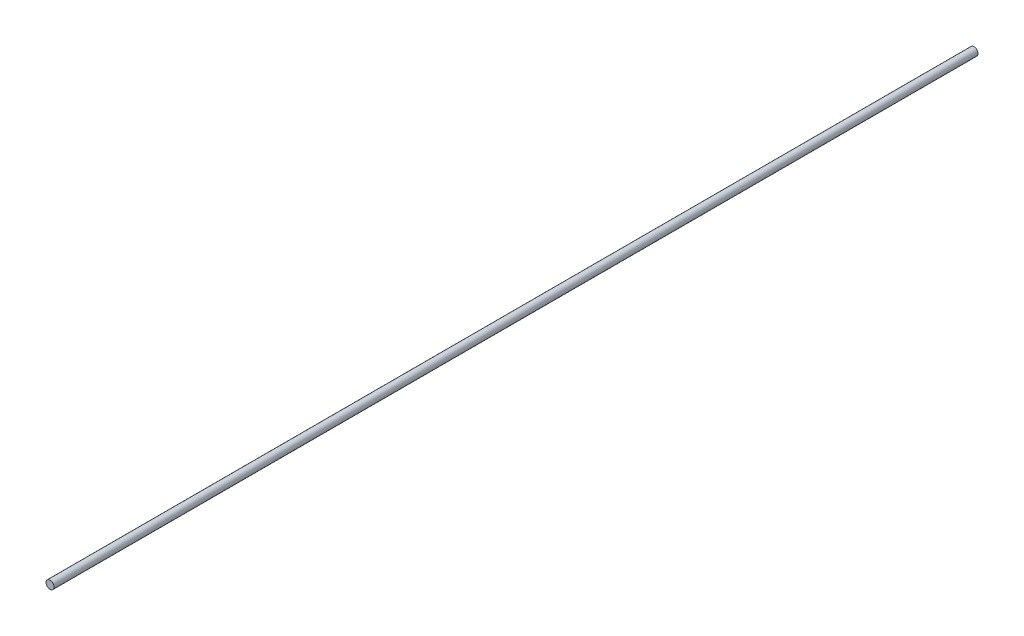
ISO-10303-21;
HEADER;
FILE_DESCRIPTION(('STEP AP214'),'2;1');
FILE_NAME('part.step','',(''),(''),'','','');
FILE_SCHEMA(('AUTOMOTIVE_DESIGN { 1 0 10303 214 1 1 1 1 }'));
ENDSEC;
DATA;
#1=APPLICATION_CONTEXT('core data for automotive mechanical design processes');
#2=APPLICATION_PROTOCOL_DEFINITION('international standard','automotive_design',2000,#1);
#3=PRODUCT_CONTEXT('',#1,'mechanical');
#4=PRODUCT('Part','Part','',(#3));
#5=PRODUCT_RELATED_PRODUCT_CATEGORY('part','',(#4));
#6=PRODUCT_DEFINITION_FORMATION('','',#4);
#7=PRODUCT_DEFINITION_CONTEXT('part definition',#1,'design');
#8=PRODUCT_DEFINITION('design','',#6,#7);
#9=PRODUCT_DEFINITION_SHAPE('','',#8);
#10=(LENGTH_UNIT() NAMED_UNIT(*) SI_UNIT(.MILLI.,.METRE.));
#11=(NAMED_UNIT(*) PLANE_ANGLE_UNIT() SI_UNIT($,.RADIAN.));
#12=(NAMED_UNIT(*) SI_UNIT($,.STERADIAN.) SOLID_ANGLE_UNIT());
#13=UNCERTAINTY_MEASURE_WITH_UNIT(LENGTH_MEASURE(1.E-05),#10,'distance_accuracy_value','');
#14=(GEOMETRIC_REPRESENTATION_CONTEXT(3) GLOBAL_UNCERTAINTY_ASSIGNED_CONTEXT((#13)) GLOBAL_UNIT_ASSIGNED_CONTEXT((#10,
#11,#12)) REPRESENTATION_CONTEXT('',''));
#15=CARTESIAN_POINT('',(0.,0.,0.));
#16=DIRECTION('',(0.,0.,1.));
#17=DIRECTION('',(1.,0.,0.));
#18=AXIS2_PLACEMENT_3D('',#15,#16,#17);
#19=CARTESIAN_POINT('',(0.,0.,914.4));
#20=DIRECTION('',(0.,0.,-1.));
#21=DIRECTION('',(-1.,0.,0.));
#22=AXIS2_PLACEMENT_3D('',#19,#20,#21);
#23=CYLINDRICAL_SURFACE('',#22,7.9375);
#24=CARTESIAN_POINT('',(0.,0.,914.4));
#25=DIRECTION('',(0.,0.,1.));
#26=DIRECTION('',(1.,0.,0.));
#27=AXIS2_PLACEMENT_3D('',#24,#25,#26);
#28=CIRCLE('',#27,7.9375);
#29=CARTESIAN_POINT('',(7.9375,0.,914.4));
#30=VERTEX_POINT('',#29);
#31=EDGE_CURVE('E10',#30,#30,#28,.T.);
#32=ORIENTED_EDGE('',*,*,#31,.F.);
#33=EDGE_LOOP('',(#32));
#34=FACE_BOUND('',#33,.T.);
#35=CARTESIAN_POINT('',(0.,0.,-914.4));
#36=DIRECTION('',(0.,0.,1.));
#37=DIRECTION('',(1.,0.,0.));
#38=AXIS2_PLACEMENT_3D('',#35,#36,#37);
#39=CIRCLE('',#38,7.9375);
#40=CARTESIAN_POINT('',(7.9375,0.,-914.4));
#41=VERTEX_POINT('',#40);
#42=EDGE_CURVE('E33',#41,#41,#39,.T.);
#43=ORIENTED_EDGE('',*,*,#42,.T.);
#44=EDGE_LOOP('',(#43));
#45=FACE_BOUND('',#44,.T.);
#46=ADVANCED_FACE('F30',(#34,#45),#23,.T.);
#47=CARTESIAN_POINT('',(0.,0.,914.4));
#48=DIRECTION('',(0.,0.,1.));
#49=DIRECTION('',(1.,0.,0.));
#50=AXIS2_PLACEMENT_3D('',#47,#48,#49);
#51=PLANE('',#50);
#52=ORIENTED_EDGE('',*,*,#31,.T.);
#53=EDGE_LOOP('',(#52));
#54=FACE_BOUND('',#53,.T.);
#55=ADVANCED_FACE('F45',(#54),#51,.T.);
#56=CARTESIAN_POINT('',(0.,0.,-914.4));
#57=DIRECTION('',(0.,0.,1.));
#58=DIRECTION('',(1.,0.,0.));
#59=AXIS2_PLACEMENT_3D('',#56,#57,#58);
#60=PLANE('',#59);
#61=ORIENTED_EDGE('',*,*,#42,.F.);
#62=EDGE_LOOP('',(#61));
#63=FACE_BOUND('',#62,.T.);
#64=ADVANCED_FACE('F43',(#63),#60,.F.);
#65=CLOSED_SHELL('',(#46,#55,#64));
#66=MANIFOLD_SOLID_BREP('B2',#65);
#67=ADVANCED_BREP_SHAPE_REPRESENTATION('',(#18,#66),#14);
#68=SHAPE_DEFINITION_REPRESENTATION(#9,#67);
ENDSEC;
END-ISO-10303-21;
